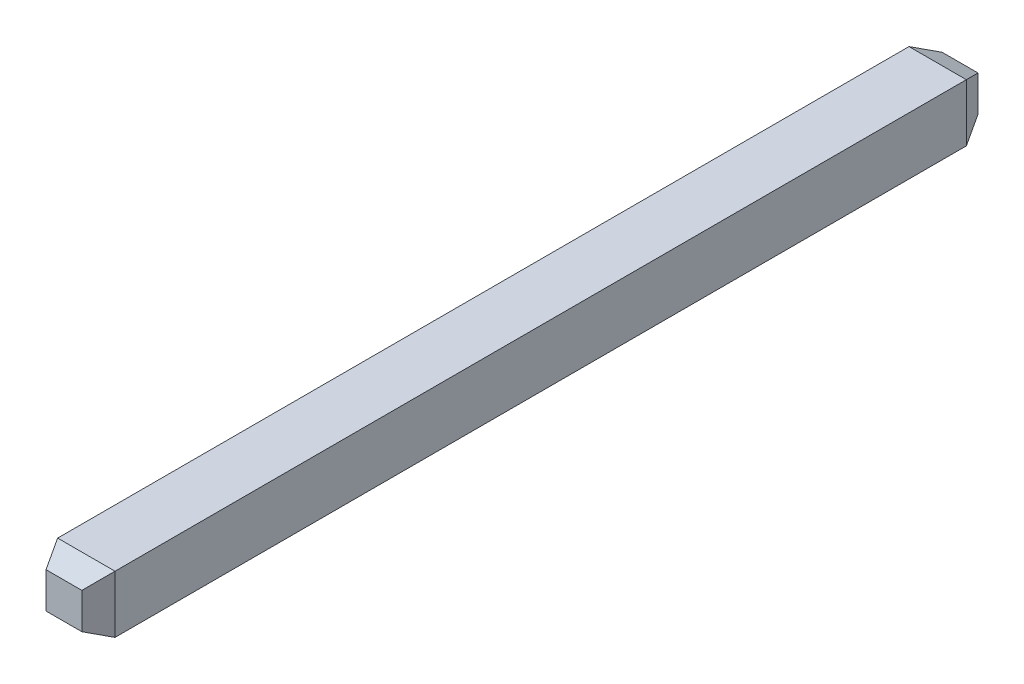
ISO-10303-21;
HEADER;
FILE_DESCRIPTION(('STEP AP214'),'2;1');
FILE_NAME('part.step','',(''),(''),'','','');
FILE_SCHEMA(('AUTOMOTIVE_DESIGN { 1 0 10303 214 1 1 1 1 }'));
ENDSEC;
DATA;
#1=APPLICATION_CONTEXT('core data for automotive mechanical design processes');
#2=APPLICATION_PROTOCOL_DEFINITION('international standard','automotive_design',2000,#1);
#3=PRODUCT_CONTEXT('',#1,'mechanical');
#4=PRODUCT('Part','Part','',(#3));
#5=PRODUCT_RELATED_PRODUCT_CATEGORY('part','',(#4));
#6=PRODUCT_DEFINITION_FORMATION('','',#4);
#7=PRODUCT_DEFINITION_CONTEXT('part definition',#1,'design');
#8=PRODUCT_DEFINITION('design','',#6,#7);
#9=PRODUCT_DEFINITION_SHAPE('','',#8);
#10=(LENGTH_UNIT() NAMED_UNIT(*) SI_UNIT(.MILLI.,.METRE.));
#11=(NAMED_UNIT(*) PLANE_ANGLE_UNIT() SI_UNIT($,.RADIAN.));
#12=(NAMED_UNIT(*) SI_UNIT($,.STERADIAN.) SOLID_ANGLE_UNIT());
#13=UNCERTAINTY_MEASURE_WITH_UNIT(LENGTH_MEASURE(1.E-05),#10,'distance_accuracy_value','');
#14=(GEOMETRIC_REPRESENTATION_CONTEXT(3) GLOBAL_UNCERTAINTY_ASSIGNED_CONTEXT((#13)) GLOBAL_UNIT_ASSIGNED_CONTEXT((#10,
#11,#12)) REPRESENTATION_CONTEXT('',''));
#15=CARTESIAN_POINT('',(0.,0.,0.));
#16=DIRECTION('',(0.,0.,1.));
#17=DIRECTION('',(1.,0.,0.));
#18=AXIS2_PLACEMENT_3D('',#15,#16,#17);
#19=CARTESIAN_POINT('',(0.16,0.32,2.5));
#20=DIRECTION('',(0.,1.,0.));
#21=DIRECTION('',(1.,0.,0.));
#22=AXIS2_PLACEMENT_3D('',#19,#20,#21);
#23=PLANE('',#22);
#24=DIRECTION('',(1.,0.,0.));
#25=VECTOR('',#24,1.);
#26=CARTESIAN_POINT('',(-0.08,0.32,4.75));
#27=LINE('',#26,#25);
#28=CARTESIAN_POINT('',(-0.32,0.32,4.75));
#29=VERTEX_POINT('',#28);
#30=CARTESIAN_POINT('',(0.32,0.32,4.75));
#31=VERTEX_POINT('',#30);
#32=EDGE_CURVE('E59',#29,#31,#27,.T.);
#33=ORIENTED_EDGE('',*,*,#32,.T.);
#34=DIRECTION('',(0.,0.,-1.));
#35=VECTOR('',#34,1.);
#36=CARTESIAN_POINT('',(0.32,0.32,0.));
#37=LINE('',#36,#35);
#38=CARTESIAN_POINT('',(0.32,0.32,-4.75));
#39=VERTEX_POINT('',#38);
#40=EDGE_CURVE('E27',#31,#39,#37,.T.);
#41=ORIENTED_EDGE('',*,*,#40,.T.);
#42=DIRECTION('',(1.,0.,0.));
#43=VECTOR('',#42,1.);
#44=CARTESIAN_POINT('',(-0.08,0.32,-4.75));
#45=LINE('',#44,#43);
#46=CARTESIAN_POINT('',(-0.32,0.32,-4.75));
#47=VERTEX_POINT('',#46);
#48=EDGE_CURVE('E87',#47,#39,#45,.T.);
#49=ORIENTED_EDGE('',*,*,#48,.F.);
#50=DIRECTION('',(0.,0.,-1.));
#51=VECTOR('',#50,1.);
#52=CARTESIAN_POINT('',(-0.32,0.32,0.));
#53=LINE('',#52,#51);
#54=EDGE_CURVE('E81',#29,#47,#53,.T.);
#55=ORIENTED_EDGE('',*,*,#54,.F.);
#56=EDGE_LOOP('',(#33,#41,#49,#55));
#57=FACE_BOUND('',#56,.T.);
#58=ADVANCED_FACE('F17',(#57),#23,.T.);
#59=CARTESIAN_POINT('',(0.2,0.,5.));
#60=DIRECTION('',(0.901523057468274,0.,0.432731067584771));
#61=DIRECTION('',(0.,-1.,0.));
#62=AXIS2_PLACEMENT_3D('',#59,#60,#61);
#63=PLANE('',#62);
#64=DIRECTION('',(0.397142035392897,0.397142035392897,-0.827379240401869));
#65=VECTOR('',#64,1.);
#66=CARTESIAN_POINT('',(0.218992332968237,0.218992332968237,4.96043263964951));
#67=LINE('',#66,#65);
#68=CARTESIAN_POINT('',(0.2,0.2,5.));
#69=VERTEX_POINT('',#68);
#70=EDGE_CURVE('E64',#69,#31,#67,.T.);
#71=ORIENTED_EDGE('',*,*,#70,.F.);
#72=DIRECTION('',(0.,1.,0.));
#73=VECTOR('',#72,1.);
#74=CARTESIAN_POINT('',(0.2,0.,5.));
#75=LINE('',#74,#73);
#76=CARTESIAN_POINT('',(0.2,-0.2,5.));
#77=VERTEX_POINT('',#76);
#78=EDGE_CURVE('E109',#77,#69,#75,.T.);
#79=ORIENTED_EDGE('',*,*,#78,.F.);
#80=DIRECTION('',(0.397142035392897,-0.397142035392897,-0.827379240401869));
#81=VECTOR('',#80,1.);
#82=CARTESIAN_POINT('',(0.218992332968237,-0.218992332968237,4.96043263964951));
#83=LINE('',#82,#81);
#84=CARTESIAN_POINT('',(0.32,-0.32,4.75));
#85=VERTEX_POINT('',#84);
#86=EDGE_CURVE('E160',#77,#85,#83,.T.);
#87=ORIENTED_EDGE('',*,*,#86,.T.);
#88=DIRECTION('',(0.,1.,0.));
#89=VECTOR('',#88,1.);
#90=CARTESIAN_POINT('',(0.32,0.,4.75));
#91=LINE('',#90,#89);
#92=EDGE_CURVE('E11',#85,#31,#91,.T.);
#93=ORIENTED_EDGE('',*,*,#92,.T.);
#94=EDGE_LOOP('',(#71,#79,#87,#93));
#95=FACE_BOUND('',#94,.T.);
#96=ADVANCED_FACE('F19',(#95),#63,.T.);
#97=CARTESIAN_POINT('',(0.32,0.,4.75));
#98=DIRECTION('',(1.,0.,0.));
#99=DIRECTION('',(0.,1.,0.));
#100=AXIS2_PLACEMENT_3D('',#97,#98,#99);
#101=PLANE('',#100);
#102=ORIENTED_EDGE('',*,*,#40,.F.);
#103=ORIENTED_EDGE('',*,*,#92,.F.);
#104=DIRECTION('',(0.,0.,-1.));
#105=VECTOR('',#104,1.);
#106=CARTESIAN_POINT('',(0.32,-0.32,0.));
#107=LINE('',#106,#105);
#108=CARTESIAN_POINT('',(0.32,-0.32,-4.75));
#109=VERTEX_POINT('',#108);
#110=EDGE_CURVE('E98',#85,#109,#107,.T.);
#111=ORIENTED_EDGE('',*,*,#110,.T.);
#112=DIRECTION('',(0.,1.,0.));
#113=VECTOR('',#112,1.);
#114=CARTESIAN_POINT('',(0.32,0.,-4.75));
#115=LINE('',#114,#113);
#116=EDGE_CURVE('E163',#109,#39,#115,.T.);
#117=ORIENTED_EDGE('',*,*,#116,.T.);
#118=EDGE_LOOP('',(#102,#103,#111,#117));
#119=FACE_BOUND('',#118,.T.);
#120=ADVANCED_FACE('F273',(#119),#101,.T.);
#121=CARTESIAN_POINT('',(0.,0.,5.));
#122=DIRECTION('',(0.,0.,1.));
#123=DIRECTION('',(1.,0.,0.));
#124=AXIS2_PLACEMENT_3D('',#121,#122,#123);
#125=PLANE('',#124);
#126=DIRECTION('',(1.,0.,0.));
#127=VECTOR('',#126,1.);
#128=CARTESIAN_POINT('',(0.,0.2,5.));
#129=LINE('',#128,#127);
#130=CARTESIAN_POINT('',(-0.2,0.2,5.));
#131=VERTEX_POINT('',#130);
#132=EDGE_CURVE('E69',#131,#69,#129,.T.);
#133=ORIENTED_EDGE('',*,*,#132,.F.);
#134=DIRECTION('',(0.,-1.,0.));
#135=VECTOR('',#134,1.);
#136=CARTESIAN_POINT('',(-0.2,0.,5.));
#137=LINE('',#136,#135);
#138=CARTESIAN_POINT('',(-0.2,-0.2,5.));
#139=VERTEX_POINT('',#138);
#140=EDGE_CURVE('E79',#131,#139,#137,.T.);
#141=ORIENTED_EDGE('',*,*,#140,.T.);
#142=DIRECTION('',(1.,0.,0.));
#143=VECTOR('',#142,1.);
#144=CARTESIAN_POINT('',(0.,-0.2,5.));
#145=LINE('',#144,#143);
#146=EDGE_CURVE('E132',#139,#77,#145,.T.);
#147=ORIENTED_EDGE('',*,*,#146,.T.);
#148=ORIENTED_EDGE('',*,*,#78,.T.);
#149=EDGE_LOOP('',(#133,#141,#147,#148));
#150=FACE_BOUND('',#149,.T.);
#151=ADVANCED_FACE('F267',(#150),#125,.T.);
#152=CARTESIAN_POINT('',(0.,0.32,4.75));
#153=DIRECTION('',(0.,0.901523057468274,0.432731067584771));
#154=DIRECTION('',(1.,0.,0.));
#155=AXIS2_PLACEMENT_3D('',#152,#153,#154);
#156=PLANE('',#155);
#157=ORIENTED_EDGE('',*,*,#70,.T.);
#158=ORIENTED_EDGE('',*,*,#32,.F.);
#159=DIRECTION('',(-0.397142035392897,0.397142035392897,-0.827379240401869));
#160=VECTOR('',#159,1.);
#161=CARTESIAN_POINT('',(-0.218992332968237,0.218992332968237,4.96043263964951));
#162=LINE('',#161,#160);
#163=EDGE_CURVE('E63',#131,#29,#162,.T.);
#164=ORIENTED_EDGE('',*,*,#163,.F.);
#165=ORIENTED_EDGE('',*,*,#132,.T.);
#166=EDGE_LOOP('',(#157,#158,#164,#165));
#167=FACE_BOUND('',#166,.T.);
#168=ADVANCED_FACE('F61',(#167),#156,.T.);
#169=CARTESIAN_POINT('',(-0.2,0.,5.));
#170=DIRECTION('',(0.901523057468274,0.,-0.432731067584771));
#171=DIRECTION('',(0.,-1.,0.));
#172=AXIS2_PLACEMENT_3D('',#169,#170,#171);
#173=PLANE('',#172);
#174=ORIENTED_EDGE('',*,*,#163,.T.);
#175=DIRECTION('',(0.,1.,0.));
#176=VECTOR('',#175,1.);
#177=CARTESIAN_POINT('',(-0.32,0.,4.75));
#178=LINE('',#177,#176);
#179=CARTESIAN_POINT('',(-0.32,-0.32,4.75));
#180=VERTEX_POINT('',#179);
#181=EDGE_CURVE('E76',#180,#29,#178,.T.);
#182=ORIENTED_EDGE('',*,*,#181,.F.);
#183=DIRECTION('',(-0.397142035392897,-0.397142035392897,-0.827379240401869));
#184=VECTOR('',#183,1.);
#185=CARTESIAN_POINT('',(-0.218992332968237,-0.218992332968237,4.96043263964951));
#186=LINE('',#185,#184);
#187=EDGE_CURVE('E127',#139,#180,#186,.T.);
#188=ORIENTED_EDGE('',*,*,#187,.F.);
#189=ORIENTED_EDGE('',*,*,#140,.F.);
#190=EDGE_LOOP('',(#174,#182,#188,#189));
#191=FACE_BOUND('',#190,.T.);
#192=ADVANCED_FACE('F73',(#191),#173,.F.);
#193=CARTESIAN_POINT('',(-0.32,0.,4.75));
#194=DIRECTION('',(1.,0.,0.));
#195=DIRECTION('',(0.,0.,-1.));
#196=AXIS2_PLACEMENT_3D('',#193,#194,#195);
#197=PLANE('',#196);
#198=ORIENTED_EDGE('',*,*,#181,.T.);
#199=ORIENTED_EDGE('',*,*,#54,.T.);
#200=DIRECTION('',(0.,1.,0.));
#201=VECTOR('',#200,1.);
#202=CARTESIAN_POINT('',(-0.32,0.,-4.75));
#203=LINE('',#202,#201);
#204=CARTESIAN_POINT('',(-0.32,-0.32,-4.75));
#205=VERTEX_POINT('',#204);
#206=EDGE_CURVE('E156',#205,#47,#203,.T.);
#207=ORIENTED_EDGE('',*,*,#206,.F.);
#208=DIRECTION('',(0.,0.,1.));
#209=VECTOR('',#208,1.);
#210=CARTESIAN_POINT('',(-0.32,-0.32,0.));
#211=LINE('',#210,#209);
#212=EDGE_CURVE('E95',#205,#180,#211,.T.);
#213=ORIENTED_EDGE('',*,*,#212,.T.);
#214=EDGE_LOOP('',(#198,#199,#207,#213));
#215=FACE_BOUND('',#214,.T.);
#216=ADVANCED_FACE('F93',(#215),#197,.F.);
#217=CARTESIAN_POINT('',(0.16,-0.32,2.5));
#218=DIRECTION('',(0.,1.,0.));
#219=DIRECTION('',(1.,0.,0.));
#220=AXIS2_PLACEMENT_3D('',#217,#218,#219);
#221=PLANE('',#220);
#222=DIRECTION('',(1.,0.,0.));
#223=VECTOR('',#222,1.);
#224=CARTESIAN_POINT('',(-0.08,-0.32,4.75));
#225=LINE('',#224,#223);
#226=EDGE_CURVE('E131',#180,#85,#225,.T.);
#227=ORIENTED_EDGE('',*,*,#226,.F.);
#228=ORIENTED_EDGE('',*,*,#212,.F.);
#229=DIRECTION('',(1.,0.,0.));
#230=VECTOR('',#229,1.);
#231=CARTESIAN_POINT('',(-0.08,-0.32,-4.75));
#232=LINE('',#231,#230);
#233=EDGE_CURVE('E125',#205,#109,#232,.T.);
#234=ORIENTED_EDGE('',*,*,#233,.T.);
#235=ORIENTED_EDGE('',*,*,#110,.F.);
#236=EDGE_LOOP('',(#227,#228,#234,#235));
#237=FACE_BOUND('',#236,.T.);
#238=ADVANCED_FACE('F293',(#237),#221,.F.);
#239=CARTESIAN_POINT('',(0.,-0.32,4.75));
#240=DIRECTION('',(0.,0.901523057468274,-0.432731067584771));
#241=DIRECTION('',(-1.,0.,0.));
#242=AXIS2_PLACEMENT_3D('',#239,#240,#241);
#243=PLANE('',#242);
#244=ORIENTED_EDGE('',*,*,#86,.F.);
#245=ORIENTED_EDGE('',*,*,#146,.F.);
#246=ORIENTED_EDGE('',*,*,#187,.T.);
#247=ORIENTED_EDGE('',*,*,#226,.T.);
#248=EDGE_LOOP('',(#244,#245,#246,#247));
#249=FACE_BOUND('',#248,.T.);
#250=ADVANCED_FACE('F271',(#249),#243,.F.);
#251=CARTESIAN_POINT('',(0.2,0.,-5.));
#252=DIRECTION('',(-0.901523057468274,0.,0.432731067584771));
#253=DIRECTION('',(0.,1.,0.));
#254=AXIS2_PLACEMENT_3D('',#251,#252,#253);
#255=PLANE('',#254);
#256=DIRECTION('',(0.397142035392897,0.397142035392897,0.827379240401869));
#257=VECTOR('',#256,1.);
#258=CARTESIAN_POINT('',(0.218992332968237,0.218992332968237,-4.96043263964951));
#259=LINE('',#258,#257);
#260=CARTESIAN_POINT('',(0.2,0.2,-5.));
#261=VERTEX_POINT('',#260);
#262=EDGE_CURVE('E159',#261,#39,#259,.T.);
#263=ORIENTED_EDGE('',*,*,#262,.T.);
#264=ORIENTED_EDGE('',*,*,#116,.F.);
#265=DIRECTION('',(0.397142035392897,-0.397142035392897,0.827379240401869));
#266=VECTOR('',#265,1.);
#267=CARTESIAN_POINT('',(0.218992332968237,-0.218992332968237,-4.96043263964951));
#268=LINE('',#267,#266);
#269=CARTESIAN_POINT('',(0.2,-0.2,-5.));
#270=VERTEX_POINT('',#269);
#271=EDGE_CURVE('E216',#270,#109,#268,.T.);
#272=ORIENTED_EDGE('',*,*,#271,.F.);
#273=DIRECTION('',(0.,1.,0.));
#274=VECTOR('',#273,1.);
#275=CARTESIAN_POINT('',(0.2,0.,-5.));
#276=LINE('',#275,#274);
#277=EDGE_CURVE('E151',#270,#261,#276,.T.);
#278=ORIENTED_EDGE('',*,*,#277,.T.);
#279=EDGE_LOOP('',(#263,#264,#272,#278));
#280=FACE_BOUND('',#279,.T.);
#281=ADVANCED_FACE('F235',(#280),#255,.F.);
#282=CARTESIAN_POINT('',(0.,0.,-5.));
#283=DIRECTION('',(0.,0.,1.));
#284=DIRECTION('',(1.,0.,0.));
#285=AXIS2_PLACEMENT_3D('',#282,#283,#284);
#286=PLANE('',#285);
#287=DIRECTION('',(1.,0.,0.));
#288=VECTOR('',#287,1.);
#289=CARTESIAN_POINT('',(0.,0.2,-5.));
#290=LINE('',#289,#288);
#291=CARTESIAN_POINT('',(-0.2,0.2,-5.));
#292=VERTEX_POINT('',#291);
#293=EDGE_CURVE('E152',#292,#261,#290,.T.);
#294=ORIENTED_EDGE('',*,*,#293,.T.);
#295=ORIENTED_EDGE('',*,*,#277,.F.);
#296=DIRECTION('',(1.,0.,0.));
#297=VECTOR('',#296,1.);
#298=CARTESIAN_POINT('',(0.,-0.2,-5.));
#299=LINE('',#298,#297);
#300=CARTESIAN_POINT('',(-0.2,-0.2,-5.));
#301=VERTEX_POINT('',#300);
#302=EDGE_CURVE('E137',#301,#270,#299,.T.);
#303=ORIENTED_EDGE('',*,*,#302,.F.);
#304=DIRECTION('',(0.,-1.,0.));
#305=VECTOR('',#304,1.);
#306=CARTESIAN_POINT('',(-0.2,0.,-5.));
#307=LINE('',#306,#305);
#308=EDGE_CURVE('E148',#292,#301,#307,.T.);
#309=ORIENTED_EDGE('',*,*,#308,.F.);
#310=EDGE_LOOP('',(#294,#295,#303,#309));
#311=FACE_BOUND('',#310,.T.);
#312=ADVANCED_FACE('F289',(#311),#286,.F.);
#313=CARTESIAN_POINT('',(0.,0.32,-4.75));
#314=DIRECTION('',(0.,-0.901523057468274,0.432731067584771));
#315=DIRECTION('',(-1.,0.,0.));
#316=AXIS2_PLACEMENT_3D('',#313,#314,#315);
#317=PLANE('',#316);
#318=ORIENTED_EDGE('',*,*,#262,.F.);
#319=ORIENTED_EDGE('',*,*,#293,.F.);
#320=DIRECTION('',(-0.397142035392897,0.397142035392897,0.827379240401869));
#321=VECTOR('',#320,1.);
#322=CARTESIAN_POINT('',(-0.218992332968236,0.218992332968237,-4.96043263964951));
#323=LINE('',#322,#321);
#324=EDGE_CURVE('E141',#292,#47,#323,.T.);
#325=ORIENTED_EDGE('',*,*,#324,.T.);
#326=ORIENTED_EDGE('',*,*,#48,.T.);
#327=EDGE_LOOP('',(#318,#319,#325,#326));
#328=FACE_BOUND('',#327,.T.);
#329=ADVANCED_FACE('F286',(#328),#317,.F.);
#330=CARTESIAN_POINT('',(-0.2,0.,-5.));
#331=DIRECTION('',(-0.901523057468274,0.,-0.432731067584771));
#332=DIRECTION('',(-0.432731067584771,0.,0.901523057468274));
#333=AXIS2_PLACEMENT_3D('',#330,#331,#332);
#334=PLANE('',#333);
#335=ORIENTED_EDGE('',*,*,#324,.F.);
#336=ORIENTED_EDGE('',*,*,#308,.T.);
#337=DIRECTION('',(-0.397142035392897,-0.397142035392897,0.827379240401869));
#338=VECTOR('',#337,1.);
#339=CARTESIAN_POINT('',(-0.218992332968236,-0.218992332968237,-4.96043263964951));
#340=LINE('',#339,#338);
#341=EDGE_CURVE('E133',#301,#205,#340,.T.);
#342=ORIENTED_EDGE('',*,*,#341,.T.);
#343=ORIENTED_EDGE('',*,*,#206,.T.);
#344=EDGE_LOOP('',(#335,#336,#342,#343));
#345=FACE_BOUND('',#344,.T.);
#346=ADVANCED_FACE('F284',(#345),#334,.T.);
#347=CARTESIAN_POINT('',(0.,-0.32,-4.75));
#348=DIRECTION('',(0.,-0.901523057468274,-0.432731067584771));
#349=DIRECTION('',(0.,0.432731067584771,-0.901523057468274));
#350=AXIS2_PLACEMENT_3D('',#347,#348,#349);
#351=PLANE('',#350);
#352=ORIENTED_EDGE('',*,*,#271,.T.);
#353=ORIENTED_EDGE('',*,*,#233,.F.);
#354=ORIENTED_EDGE('',*,*,#341,.F.);
#355=ORIENTED_EDGE('',*,*,#302,.T.);
#356=EDGE_LOOP('',(#352,#353,#354,#355));
#357=FACE_BOUND('',#356,.T.);
#358=ADVANCED_FACE('F226',(#357),#351,.T.);
#359=CLOSED_SHELL('',(#58,#96,#120,#151,#168,#192,#216,#238,#250,#281,#312,#329,#346,#358));
#360=MANIFOLD_SOLID_BREP('B1',#359);
#361=ADVANCED_BREP_SHAPE_REPRESENTATION('',(#18,#360),#14);
#362=SHAPE_DEFINITION_REPRESENTATION(#9,#361);
ENDSEC;
END-ISO-10303-21;
